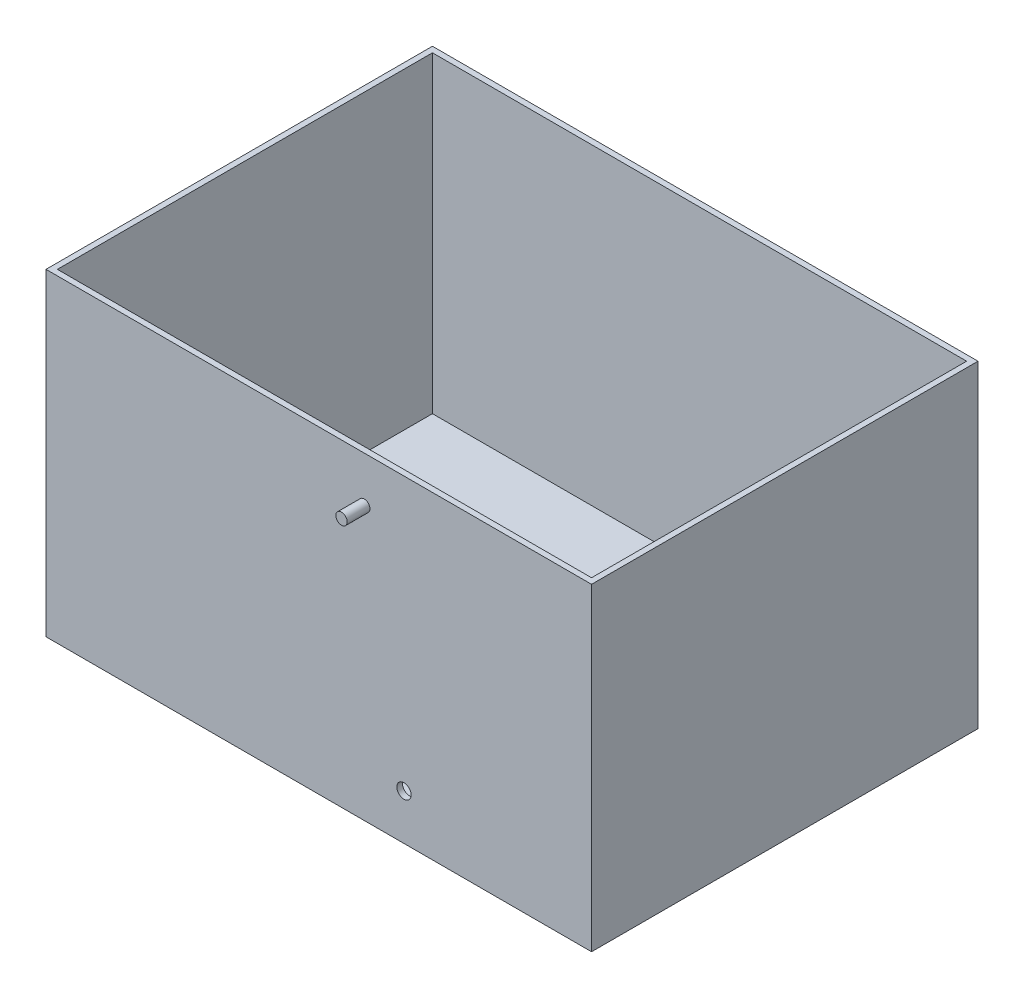
ISO-10303-21;
HEADER;
FILE_DESCRIPTION(('STEP AP214'),'2;1');
FILE_NAME('part.step','',(''),(''),'','','');
FILE_SCHEMA(('AUTOMOTIVE_DESIGN { 1 0 10303 214 1 1 1 1 }'));
ENDSEC;
DATA;
#1=APPLICATION_CONTEXT('core data for automotive mechanical design processes');
#2=APPLICATION_PROTOCOL_DEFINITION('international standard','automotive_design',2000,#1);
#3=PRODUCT_CONTEXT('',#1,'mechanical');
#4=PRODUCT('Part','Part','',(#3));
#5=PRODUCT_RELATED_PRODUCT_CATEGORY('part','',(#4));
#6=PRODUCT_DEFINITION_FORMATION('','',#4);
#7=PRODUCT_DEFINITION_CONTEXT('part definition',#1,'design');
#8=PRODUCT_DEFINITION('design','',#6,#7);
#9=PRODUCT_DEFINITION_SHAPE('','',#8);
#10=(LENGTH_UNIT() NAMED_UNIT(*) SI_UNIT(.MILLI.,.METRE.));
#11=(NAMED_UNIT(*) PLANE_ANGLE_UNIT() SI_UNIT($,.RADIAN.));
#12=(NAMED_UNIT(*) SI_UNIT($,.STERADIAN.) SOLID_ANGLE_UNIT());
#13=UNCERTAINTY_MEASURE_WITH_UNIT(LENGTH_MEASURE(1.E-05),#10,'distance_accuracy_value','');
#14=(GEOMETRIC_REPRESENTATION_CONTEXT(3) GLOBAL_UNCERTAINTY_ASSIGNED_CONTEXT((#13)) GLOBAL_UNIT_ASSIGNED_CONTEXT((#10,
#11,#12)) REPRESENTATION_CONTEXT('',''));
#15=CARTESIAN_POINT('',(0.,0.,0.));
#16=DIRECTION('',(0.,0.,1.));
#17=DIRECTION('',(1.,0.,0.));
#18=AXIS2_PLACEMENT_3D('',#15,#16,#17);
#19=CARTESIAN_POINT('',(0.,3.175,0.));
#20=DIRECTION('',(0.,1.,0.));
#21=DIRECTION('',(0.,0.,1.));
#22=AXIS2_PLACEMENT_3D('',#19,#20,#21);
#23=PLANE('',#22);
#24=DIRECTION('',(1.,0.,0.));
#25=VECTOR('',#24,1.);
#26=CARTESIAN_POINT('',(0.,3.175,104.775));
#27=LINE('',#26,#25);
#28=CARTESIAN_POINT('',(-149.225,3.17500000000001,104.775));
#29=VERTEX_POINT('',#28);
#30=CARTESIAN_POINT('',(149.225,3.175,104.775));
#31=VERTEX_POINT('',#30);
#32=EDGE_CURVE('E169',#29,#31,#27,.T.);
#33=ORIENTED_EDGE('',*,*,#32,.T.);
#34=DIRECTION('',(0.,0.,-1.));
#35=VECTOR('',#34,1.);
#36=CARTESIAN_POINT('',(149.225,3.175,0.));
#37=LINE('',#36,#35);
#38=CARTESIAN_POINT('',(149.225,3.17500000000001,-104.775));
#39=VERTEX_POINT('',#38);
#40=EDGE_CURVE('E172',#31,#39,#37,.T.);
#41=ORIENTED_EDGE('',*,*,#40,.T.);
#42=DIRECTION('',(1.,0.,0.));
#43=VECTOR('',#42,1.);
#44=CARTESIAN_POINT('',(0.,3.175,-104.775));
#45=LINE('',#44,#43);
#46=CARTESIAN_POINT('',(-149.225,3.17500000000001,-104.775));
#47=VERTEX_POINT('',#46);
#48=EDGE_CURVE('E67',#47,#39,#45,.T.);
#49=ORIENTED_EDGE('',*,*,#48,.F.);
#50=DIRECTION('',(0.,0.,-1.));
#51=VECTOR('',#50,1.);
#52=CARTESIAN_POINT('',(-149.225,3.175,0.));
#53=LINE('',#52,#51);
#54=EDGE_CURVE('E52',#29,#47,#53,.T.);
#55=ORIENTED_EDGE('',*,*,#54,.F.);
#56=EDGE_LOOP('',(#33,#41,#49,#55));
#57=FACE_BOUND('',#56,.T.);
#58=ADVANCED_FACE('F43',(#57),#23,.T.);
#59=CARTESIAN_POINT('',(0.,177.8,0.));
#60=DIRECTION('',(0.,1.,0.));
#61=DIRECTION('',(0.,0.,1.));
#62=AXIS2_PLACEMENT_3D('',#59,#60,#61);
#63=PLANE('',#62);
#64=DIRECTION('',(0.,0.,-1.));
#65=VECTOR('',#64,1.);
#66=CARTESIAN_POINT('',(152.4,177.8,-107.95));
#67=LINE('',#66,#65);
#68=CARTESIAN_POINT('',(152.4,177.8,107.95));
#69=VERTEX_POINT('',#68);
#70=CARTESIAN_POINT('',(152.4,177.8,-107.95));
#71=VERTEX_POINT('',#70);
#72=EDGE_CURVE('E140',#69,#71,#67,.T.);
#73=ORIENTED_EDGE('',*,*,#72,.T.);
#74=DIRECTION('',(-1.,0.,0.));
#75=VECTOR('',#74,1.);
#76=CARTESIAN_POINT('',(-152.4,177.8,-107.95));
#77=LINE('',#76,#75);
#78=CARTESIAN_POINT('',(-152.4,177.8,-107.95));
#79=VERTEX_POINT('',#78);
#80=EDGE_CURVE('E143',#71,#79,#77,.T.);
#81=ORIENTED_EDGE('',*,*,#80,.T.);
#82=DIRECTION('',(0.,0.,1.));
#83=VECTOR('',#82,1.);
#84=CARTESIAN_POINT('',(-152.4,177.8,-107.95));
#85=LINE('',#84,#83);
#86=CARTESIAN_POINT('',(-152.4,177.8,107.95));
#87=VERTEX_POINT('',#86);
#88=EDGE_CURVE('E146',#79,#87,#85,.T.);
#89=ORIENTED_EDGE('',*,*,#88,.T.);
#90=DIRECTION('',(1.,0.,0.));
#91=VECTOR('',#90,1.);
#92=CARTESIAN_POINT('',(-152.4,177.8,107.95));
#93=LINE('',#92,#91);
#94=EDGE_CURVE('E148',#87,#69,#93,.T.);
#95=ORIENTED_EDGE('',*,*,#94,.T.);
#96=EDGE_LOOP('',(#73,#81,#89,#95));
#97=FACE_BOUND('',#96,.T.);
#98=DIRECTION('',(-1.,0.,0.));
#99=VECTOR('',#98,1.);
#100=CARTESIAN_POINT('',(-149.225,177.8,-104.775));
#101=LINE('',#100,#99);
#102=CARTESIAN_POINT('',(149.225,177.8,-104.775));
#103=VERTEX_POINT('',#102);
#104=CARTESIAN_POINT('',(-149.225,177.8,-104.775));
#105=VERTEX_POINT('',#104);
#106=EDGE_CURVE('E117',#103,#105,#101,.T.);
#107=ORIENTED_EDGE('',*,*,#106,.F.);
#108=DIRECTION('',(0.,0.,-1.));
#109=VECTOR('',#108,1.);
#110=CARTESIAN_POINT('',(149.225,177.8,104.775));
#111=LINE('',#110,#109);
#112=CARTESIAN_POINT('',(149.225,177.8,104.775));
#113=VERTEX_POINT('',#112);
#114=EDGE_CURVE('E110',#113,#103,#111,.T.);
#115=ORIENTED_EDGE('',*,*,#114,.F.);
#116=DIRECTION('',(1.,0.,0.));
#117=VECTOR('',#116,1.);
#118=CARTESIAN_POINT('',(-149.225,177.8,104.775));
#119=LINE('',#118,#117);
#120=CARTESIAN_POINT('',(-149.225,177.8,104.775));
#121=VERTEX_POINT('',#120);
#122=EDGE_CURVE('E130',#121,#113,#119,.T.);
#123=ORIENTED_EDGE('',*,*,#122,.F.);
#124=DIRECTION('',(0.,0.,1.));
#125=VECTOR('',#124,1.);
#126=CARTESIAN_POINT('',(-149.225,177.8,104.775));
#127=LINE('',#126,#125);
#128=EDGE_CURVE('E128',#105,#121,#127,.T.);
#129=ORIENTED_EDGE('',*,*,#128,.F.);
#130=EDGE_LOOP('',(#107,#115,#123,#129));
#131=FACE_BOUND('',#130,.T.);
#132=ADVANCED_FACE('F126',(#97,#131),#63,.T.);
#133=CARTESIAN_POINT('',(152.4,177.8,-107.95));
#134=DIRECTION('',(-1.,0.,0.));
#135=DIRECTION('',(0.,0.,1.));
#136=AXIS2_PLACEMENT_3D('',#133,#134,#135);
#137=PLANE('',#136);
#138=DIRECTION('',(0.,0.,-1.));
#139=VECTOR('',#138,1.);
#140=CARTESIAN_POINT('',(152.4,0.,-107.95));
#141=LINE('',#140,#139);
#142=CARTESIAN_POINT('',(152.4,0.,107.95));
#143=VERTEX_POINT('',#142);
#144=CARTESIAN_POINT('',(152.4,0.,-107.95));
#145=VERTEX_POINT('',#144);
#146=EDGE_CURVE('E122',#143,#145,#141,.T.);
#147=ORIENTED_EDGE('',*,*,#146,.T.);
#148=DIRECTION('',(0.,-1.,0.));
#149=VECTOR('',#148,1.);
#150=CARTESIAN_POINT('',(152.4,177.8,-107.95));
#151=LINE('',#150,#149);
#152=EDGE_CURVE('E166',#71,#145,#151,.T.);
#153=ORIENTED_EDGE('',*,*,#152,.F.);
#154=ORIENTED_EDGE('',*,*,#72,.F.);
#155=DIRECTION('',(0.,-1.,0.));
#156=VECTOR('',#155,1.);
#157=CARTESIAN_POINT('',(152.4,177.8,107.95));
#158=LINE('',#157,#156);
#159=EDGE_CURVE('E150',#69,#143,#158,.T.);
#160=ORIENTED_EDGE('',*,*,#159,.T.);
#161=EDGE_LOOP('',(#147,#153,#154,#160));
#162=FACE_BOUND('',#161,.T.);
#163=ADVANCED_FACE('F198',(#162),#137,.F.);
#164=CARTESIAN_POINT('',(-152.4,177.8,-107.95));
#165=DIRECTION('',(0.,0.,1.));
#166=DIRECTION('',(1.,0.,0.));
#167=AXIS2_PLACEMENT_3D('',#164,#165,#166);
#168=PLANE('',#167);
#169=CARTESIAN_POINT('',(25.4,152.4,-107.95));
#170=DIRECTION('',(0.,0.,1.));
#171=DIRECTION('',(1.,0.,0.));
#172=AXIS2_PLACEMENT_3D('',#169,#170,#171);
#173=CIRCLE('',#172,3.175);
#174=CARTESIAN_POINT('',(28.575,152.4,-107.95));
#175=VERTEX_POINT('',#174);
#176=EDGE_CURVE('E276',#175,#175,#173,.T.);
#177=ORIENTED_EDGE('',*,*,#176,.T.);
#178=EDGE_LOOP('',(#177));
#179=FACE_BOUND('',#178,.T.);
#180=CARTESIAN_POINT('',(47.6,25.4,-107.95));
#181=DIRECTION('',(0.,0.,1.));
#182=DIRECTION('',(1.,0.,0.));
#183=AXIS2_PLACEMENT_3D('',#180,#181,#182);
#184=CIRCLE('',#183,4.);
#185=CARTESIAN_POINT('',(51.6,25.4,-107.95));
#186=VERTEX_POINT('',#185);
#187=EDGE_CURVE('E231',#186,#186,#184,.T.);
#188=ORIENTED_EDGE('',*,*,#187,.T.);
#189=EDGE_LOOP('',(#188));
#190=FACE_BOUND('',#189,.T.);
#191=DIRECTION('',(-1.,0.,0.));
#192=VECTOR('',#191,1.);
#193=CARTESIAN_POINT('',(-152.4,0.,-107.95));
#194=LINE('',#193,#192);
#195=CARTESIAN_POINT('',(-152.4,0.,-107.95));
#196=VERTEX_POINT('',#195);
#197=EDGE_CURVE('E153',#145,#196,#194,.T.);
#198=ORIENTED_EDGE('',*,*,#197,.T.);
#199=DIRECTION('',(0.,-1.,0.));
#200=VECTOR('',#199,1.);
#201=CARTESIAN_POINT('',(-152.4,177.8,-107.95));
#202=LINE('',#201,#200);
#203=EDGE_CURVE('E163',#79,#196,#202,.T.);
#204=ORIENTED_EDGE('',*,*,#203,.F.);
#205=ORIENTED_EDGE('',*,*,#80,.F.);
#206=ORIENTED_EDGE('',*,*,#152,.T.);
#207=EDGE_LOOP('',(#198,#204,#205,#206));
#208=FACE_BOUND('',#207,.T.);
#209=ADVANCED_FACE('F204',(#179,#190,#208),#168,.F.);
#210=CARTESIAN_POINT('',(-152.4,177.8,-107.95));
#211=DIRECTION('',(1.,0.,0.));
#212=DIRECTION('',(0.,0.,-1.));
#213=AXIS2_PLACEMENT_3D('',#210,#211,#212);
#214=PLANE('',#213);
#215=DIRECTION('',(0.,0.,1.));
#216=VECTOR('',#215,1.);
#217=CARTESIAN_POINT('',(-152.4,0.,-107.95));
#218=LINE('',#217,#216);
#219=CARTESIAN_POINT('',(-152.4,0.,107.95));
#220=VERTEX_POINT('',#219);
#221=EDGE_CURVE('E155',#196,#220,#218,.T.);
#222=ORIENTED_EDGE('',*,*,#221,.T.);
#223=DIRECTION('',(0.,-1.,0.));
#224=VECTOR('',#223,1.);
#225=CARTESIAN_POINT('',(-152.4,177.8,107.95));
#226=LINE('',#225,#224);
#227=EDGE_CURVE('E160',#87,#220,#226,.T.);
#228=ORIENTED_EDGE('',*,*,#227,.F.);
#229=ORIENTED_EDGE('',*,*,#88,.F.);
#230=ORIENTED_EDGE('',*,*,#203,.T.);
#231=EDGE_LOOP('',(#222,#228,#229,#230));
#232=FACE_BOUND('',#231,.T.);
#233=ADVANCED_FACE('F208',(#232),#214,.F.);
#234=CARTESIAN_POINT('',(-152.4,177.8,107.95));
#235=DIRECTION('',(0.,0.,-1.));
#236=DIRECTION('',(-1.,0.,0.));
#237=AXIS2_PLACEMENT_3D('',#234,#235,#236);
#238=PLANE('',#237);
#239=CARTESIAN_POINT('',(47.6,25.4,107.95));
#240=DIRECTION('',(0.,0.,-1.));
#241=DIRECTION('',(-1.,0.,0.));
#242=AXIS2_PLACEMENT_3D('',#239,#240,#241);
#243=CIRCLE('',#242,4.);
#244=CARTESIAN_POINT('',(43.6,25.4,107.95));
#245=VERTEX_POINT('',#244);
#246=EDGE_CURVE('E226',#245,#245,#243,.T.);
#247=ORIENTED_EDGE('',*,*,#246,.T.);
#248=EDGE_LOOP('',(#247));
#249=FACE_BOUND('',#248,.T.);
#250=CARTESIAN_POINT('',(25.4,152.4,107.95));
#251=DIRECTION('',(0.,0.,-1.));
#252=DIRECTION('',(-1.,0.,0.));
#253=AXIS2_PLACEMENT_3D('',#250,#251,#252);
#254=CIRCLE('',#253,3.175);
#255=CARTESIAN_POINT('',(22.225,152.4,107.95));
#256=VERTEX_POINT('',#255);
#257=EDGE_CURVE('E11',#256,#256,#254,.F.);
#258=ORIENTED_EDGE('',*,*,#257,.F.);
#259=EDGE_LOOP('',(#258));
#260=FACE_BOUND('',#259,.T.);
#261=DIRECTION('',(1.,0.,0.));
#262=VECTOR('',#261,1.);
#263=CARTESIAN_POINT('',(-152.4,0.,107.95));
#264=LINE('',#263,#262);
#265=EDGE_CURVE('E144',#220,#143,#264,.T.);
#266=ORIENTED_EDGE('',*,*,#265,.T.);
#267=ORIENTED_EDGE('',*,*,#159,.F.);
#268=ORIENTED_EDGE('',*,*,#94,.F.);
#269=ORIENTED_EDGE('',*,*,#227,.T.);
#270=EDGE_LOOP('',(#266,#267,#268,#269));
#271=FACE_BOUND('',#270,.T.);
#272=ADVANCED_FACE('F212',(#249,#260,#271),#238,.F.);
#273=CARTESIAN_POINT('',(149.225,177.8,104.775));
#274=DIRECTION('',(-1.,0.,0.));
#275=DIRECTION('',(0.,0.,1.));
#276=AXIS2_PLACEMENT_3D('',#273,#274,#275);
#277=PLANE('',#276);
#278=DIRECTION('',(0.,-1.,0.));
#279=VECTOR('',#278,1.);
#280=CARTESIAN_POINT('',(149.225,177.8,-104.775));
#281=LINE('',#280,#279);
#282=EDGE_CURVE('E112',#103,#39,#281,.T.);
#283=ORIENTED_EDGE('',*,*,#282,.T.);
#284=ORIENTED_EDGE('',*,*,#40,.F.);
#285=DIRECTION('',(0.,-1.,0.));
#286=VECTOR('',#285,1.);
#287=CARTESIAN_POINT('',(149.225,177.8,104.775));
#288=LINE('',#287,#286);
#289=EDGE_CURVE('E59',#113,#31,#288,.T.);
#290=ORIENTED_EDGE('',*,*,#289,.F.);
#291=ORIENTED_EDGE('',*,*,#114,.T.);
#292=EDGE_LOOP('',(#283,#284,#290,#291));
#293=FACE_BOUND('',#292,.T.);
#294=ADVANCED_FACE('F111',(#293),#277,.T.);
#295=CARTESIAN_POINT('',(-149.225,177.8,-104.775));
#296=DIRECTION('',(0.,0.,1.));
#297=DIRECTION('',(1.,0.,0.));
#298=AXIS2_PLACEMENT_3D('',#295,#296,#297);
#299=PLANE('',#298);
#300=CARTESIAN_POINT('',(47.6,25.4,-104.775));
#301=DIRECTION('',(0.,0.,1.));
#302=DIRECTION('',(1.,0.,0.));
#303=AXIS2_PLACEMENT_3D('',#300,#301,#302);
#304=CIRCLE('',#303,4.);
#305=CARTESIAN_POINT('',(51.6,25.4,-104.775));
#306=VERTEX_POINT('',#305);
#307=EDGE_CURVE('E224',#306,#306,#304,.T.);
#308=ORIENTED_EDGE('',*,*,#307,.F.);
#309=EDGE_LOOP('',(#308));
#310=FACE_BOUND('',#309,.T.);
#311=DIRECTION('',(0.,-1.,0.));
#312=VECTOR('',#311,1.);
#313=CARTESIAN_POINT('',(-149.225,177.8,-104.775));
#314=LINE('',#313,#312);
#315=EDGE_CURVE('E123',#105,#47,#314,.T.);
#316=ORIENTED_EDGE('',*,*,#315,.T.);
#317=ORIENTED_EDGE('',*,*,#48,.T.);
#318=ORIENTED_EDGE('',*,*,#282,.F.);
#319=ORIENTED_EDGE('',*,*,#106,.T.);
#320=EDGE_LOOP('',(#316,#317,#318,#319));
#321=FACE_BOUND('',#320,.T.);
#322=ADVANCED_FACE('F120',(#310,#321),#299,.T.);
#323=CARTESIAN_POINT('',(-149.225,177.8,104.775));
#324=DIRECTION('',(1.,0.,0.));
#325=DIRECTION('',(0.,0.,-1.));
#326=AXIS2_PLACEMENT_3D('',#323,#324,#325);
#327=PLANE('',#326);
#328=DIRECTION('',(0.,-1.,0.));
#329=VECTOR('',#328,1.);
#330=CARTESIAN_POINT('',(-149.225,177.8,104.775));
#331=LINE('',#330,#329);
#332=EDGE_CURVE('E136',#121,#29,#331,.T.);
#333=ORIENTED_EDGE('',*,*,#332,.T.);
#334=ORIENTED_EDGE('',*,*,#54,.T.);
#335=ORIENTED_EDGE('',*,*,#315,.F.);
#336=ORIENTED_EDGE('',*,*,#128,.T.);
#337=EDGE_LOOP('',(#333,#334,#335,#336));
#338=FACE_BOUND('',#337,.T.);
#339=ADVANCED_FACE('F177',(#338),#327,.T.);
#340=CARTESIAN_POINT('',(-149.225,177.8,104.775));
#341=DIRECTION('',(0.,0.,-1.));
#342=DIRECTION('',(-1.,0.,0.));
#343=AXIS2_PLACEMENT_3D('',#340,#341,#342);
#344=PLANE('',#343);
#345=CARTESIAN_POINT('',(47.6,25.4,104.775));
#346=DIRECTION('',(0.,0.,-1.));
#347=DIRECTION('',(-1.,0.,0.));
#348=AXIS2_PLACEMENT_3D('',#345,#346,#347);
#349=CIRCLE('',#348,4.);
#350=CARTESIAN_POINT('',(43.6,25.4,104.775));
#351=VERTEX_POINT('',#350);
#352=EDGE_CURVE('E47',#351,#351,#349,.T.);
#353=ORIENTED_EDGE('',*,*,#352,.F.);
#354=EDGE_LOOP('',(#353));
#355=FACE_BOUND('',#354,.T.);
#356=ORIENTED_EDGE('',*,*,#289,.T.);
#357=ORIENTED_EDGE('',*,*,#32,.F.);
#358=ORIENTED_EDGE('',*,*,#332,.F.);
#359=ORIENTED_EDGE('',*,*,#122,.T.);
#360=EDGE_LOOP('',(#356,#357,#358,#359));
#361=FACE_BOUND('',#360,.T.);
#362=ADVANCED_FACE('F179',(#355,#361),#344,.T.);
#363=CARTESIAN_POINT('',(0.,0.,0.));
#364=DIRECTION('',(0.,1.,0.));
#365=DIRECTION('',(0.,0.,1.));
#366=AXIS2_PLACEMENT_3D('',#363,#364,#365);
#367=PLANE('',#366);
#368=ORIENTED_EDGE('',*,*,#146,.F.);
#369=ORIENTED_EDGE('',*,*,#265,.F.);
#370=ORIENTED_EDGE('',*,*,#221,.F.);
#371=ORIENTED_EDGE('',*,*,#197,.F.);
#372=EDGE_LOOP('',(#368,#369,#370,#371));
#373=FACE_BOUND('',#372,.T.);
#374=ADVANCED_FACE('F45',(#373),#367,.F.);
#375=CARTESIAN_POINT('',(25.4,152.4,120.65));
#376=DIRECTION('',(0.,0.,-1.));
#377=DIRECTION('',(-1.,0.,0.));
#378=AXIS2_PLACEMENT_3D('',#375,#376,#377);
#379=CYLINDRICAL_SURFACE('',#378,3.175);
#380=CARTESIAN_POINT('',(25.4,152.4,120.65));
#381=DIRECTION('',(0.,0.,1.));
#382=DIRECTION('',(1.,0.,0.));
#383=AXIS2_PLACEMENT_3D('',#380,#381,#382);
#384=CIRCLE('',#383,3.175);
#385=CARTESIAN_POINT('',(28.575,152.4,120.65));
#386=VERTEX_POINT('',#385);
#387=EDGE_CURVE('E118',#386,#386,#384,.T.);
#388=ORIENTED_EDGE('',*,*,#387,.F.);
#389=EDGE_LOOP('',(#388));
#390=FACE_BOUND('',#389,.T.);
#391=ORIENTED_EDGE('',*,*,#257,.T.);
#392=EDGE_LOOP('',(#391));
#393=FACE_BOUND('',#392,.T.);
#394=ADVANCED_FACE('F188',(#390,#393),#379,.T.);
#395=CARTESIAN_POINT('',(25.4,152.4,120.65));
#396=DIRECTION('',(0.,0.,1.));
#397=DIRECTION('',(1.,0.,0.));
#398=AXIS2_PLACEMENT_3D('',#395,#396,#397);
#399=PLANE('',#398);
#400=ORIENTED_EDGE('',*,*,#387,.T.);
#401=EDGE_LOOP('',(#400));
#402=FACE_BOUND('',#401,.T.);
#403=ADVANCED_FACE('F237',(#402),#399,.T.);
#404=CARTESIAN_POINT('',(47.6,25.4,-107.95));
#405=DIRECTION('',(0.,0.,1.));
#406=DIRECTION('',(1.,0.,0.));
#407=AXIS2_PLACEMENT_3D('',#404,#405,#406);
#408=CYLINDRICAL_SURFACE('',#407,4.);
#409=ORIENTED_EDGE('',*,*,#352,.T.);
#410=EDGE_LOOP('',(#409));
#411=FACE_BOUND('',#410,.T.);
#412=ORIENTED_EDGE('',*,*,#246,.F.);
#413=EDGE_LOOP('',(#412));
#414=FACE_BOUND('',#413,.T.);
#415=ADVANCED_FACE('F258',(#411,#414),#408,.F.);
#416=ORIENTED_EDGE('',*,*,#307,.T.);
#417=EDGE_LOOP('',(#416));
#418=FACE_BOUND('',#417,.T.);
#419=ORIENTED_EDGE('',*,*,#187,.F.);
#420=EDGE_LOOP('',(#419));
#421=FACE_BOUND('',#420,.T.);
#422=ADVANCED_FACE('F262',(#418,#421),#408,.F.);
#423=CARTESIAN_POINT('',(25.4,152.4,-120.65));
#424=DIRECTION('',(0.,0.,1.));
#425=DIRECTION('',(1.,0.,0.));
#426=AXIS2_PLACEMENT_3D('',#423,#424,#425);
#427=CYLINDRICAL_SURFACE('',#426,3.175);
#428=CARTESIAN_POINT('',(25.4,152.4,-120.65));
#429=DIRECTION('',(0.,0.,1.));
#430=DIRECTION('',(1.,0.,0.));
#431=AXIS2_PLACEMENT_3D('',#428,#429,#430);
#432=CIRCLE('',#431,3.175);
#433=CARTESIAN_POINT('',(28.575,152.4,-120.65));
#434=VERTEX_POINT('',#433);
#435=EDGE_CURVE('E275',#434,#434,#432,.T.);
#436=ORIENTED_EDGE('',*,*,#435,.T.);
#437=EDGE_LOOP('',(#436));
#438=FACE_BOUND('',#437,.T.);
#439=ORIENTED_EDGE('',*,*,#176,.F.);
#440=EDGE_LOOP('',(#439));
#441=FACE_BOUND('',#440,.T.);
#442=ADVANCED_FACE('F264',(#438,#441),#427,.T.);
#443=CARTESIAN_POINT('',(25.4,152.4,-120.65));
#444=DIRECTION('',(0.,0.,-1.));
#445=DIRECTION('',(1.,0.,0.));
#446=AXIS2_PLACEMENT_3D('',#443,#444,#445);
#447=PLANE('',#446);
#448=ORIENTED_EDGE('',*,*,#435,.F.);
#449=EDGE_LOOP('',(#448));
#450=FACE_BOUND('',#449,.T.);
#451=ADVANCED_FACE('F267',(#450),#447,.T.);
#452=CLOSED_SHELL('',(#58,#132,#163,#209,#233,#272,#294,#322,#339,#362,#374,#394,#403,#415,#422,
#442,#451));
#453=MANIFOLD_SOLID_BREP('B2',#452);
#454=ADVANCED_BREP_SHAPE_REPRESENTATION('',(#18,#453),#14);
#455=SHAPE_DEFINITION_REPRESENTATION(#9,#454);
ENDSEC;
END-ISO-10303-21;
